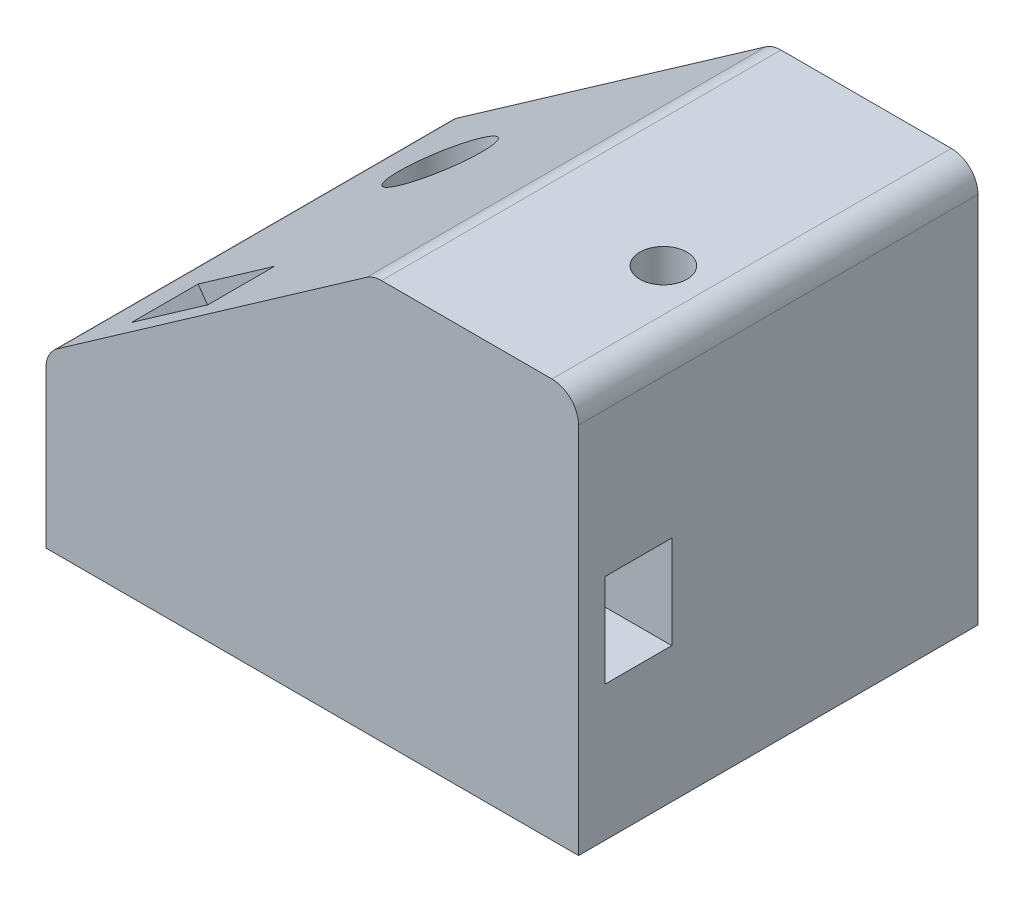
ISO-10303-21;
HEADER;
FILE_DESCRIPTION(('STEP AP214'),'2;1');
FILE_NAME('part.step','',(''),(''),'','','');
FILE_SCHEMA(('AUTOMOTIVE_DESIGN { 1 0 10303 214 1 1 1 1 }'));
ENDSEC;
DATA;
#1=APPLICATION_CONTEXT('core data for automotive mechanical design processes');
#2=APPLICATION_PROTOCOL_DEFINITION('international standard','automotive_design',2000,#1);
#3=PRODUCT_CONTEXT('',#1,'mechanical');
#4=PRODUCT('Part','Part','',(#3));
#5=PRODUCT_RELATED_PRODUCT_CATEGORY('part','',(#4));
#6=PRODUCT_DEFINITION_FORMATION('','',#4);
#7=PRODUCT_DEFINITION_CONTEXT('part definition',#1,'design');
#8=PRODUCT_DEFINITION('design','',#6,#7);
#9=PRODUCT_DEFINITION_SHAPE('','',#8);
#10=(LENGTH_UNIT() NAMED_UNIT(*) SI_UNIT(.MILLI.,.METRE.));
#11=(NAMED_UNIT(*) PLANE_ANGLE_UNIT() SI_UNIT($,.RADIAN.));
#12=(NAMED_UNIT(*) SI_UNIT($,.STERADIAN.) SOLID_ANGLE_UNIT());
#13=UNCERTAINTY_MEASURE_WITH_UNIT(LENGTH_MEASURE(1.E-05),#10,'distance_accuracy_value','');
#14=(GEOMETRIC_REPRESENTATION_CONTEXT(3) GLOBAL_UNCERTAINTY_ASSIGNED_CONTEXT((#13)) GLOBAL_UNIT_ASSIGNED_CONTEXT((#10,
#11,#12)) REPRESENTATION_CONTEXT('',''));
#15=CARTESIAN_POINT('',(0.,0.,0.));
#16=DIRECTION('',(0.,0.,1.));
#17=DIRECTION('',(1.,0.,0.));
#18=AXIS2_PLACEMENT_3D('',#15,#16,#17);
#19=CARTESIAN_POINT('',(10.414,74.93,10.922));
#20=DIRECTION('',(0.,-1.,0.));
#21=DIRECTION('',(0.,0.,-1.));
#22=AXIS2_PLACEMENT_3D('',#19,#20,#21);
#23=CYLINDRICAL_SURFACE('',#22,2.2479);
#24=CARTESIAN_POINT('',(10.414,0.,10.922));
#25=DIRECTION('',(0.,-1.,0.));
#26=DIRECTION('',(0.,0.,-1.));
#27=AXIS2_PLACEMENT_3D('',#24,#25,#26);
#28=CIRCLE('',#27,2.2479);
#29=CARTESIAN_POINT('',(10.414,0.,8.6741));
#30=VERTEX_POINT('',#29);
#31=EDGE_CURVE('E274',#30,#30,#28,.T.);
#32=ORIENTED_EDGE('',*,*,#31,.T.);
#33=EDGE_LOOP('',(#32));
#34=FACE_BOUND('',#33,.T.);
#35=CARTESIAN_POINT('',(10.414,15.24,10.922));
#36=DIRECTION('',(0.,1.,0.));
#37=DIRECTION('',(-1.,0.,0.));
#38=AXIS2_PLACEMENT_3D('',#35,#36,#37);
#39=CIRCLE('',#38,2.2479);
#40=CARTESIAN_POINT('',(8.1661,15.24,10.922));
#41=VERTEX_POINT('',#40);
#42=EDGE_CURVE('E268',#41,#41,#39,.F.);
#43=ORIENTED_EDGE('',*,*,#42,.F.);
#44=EDGE_LOOP('',(#43));
#45=FACE_BOUND('',#44,.T.);
#46=ADVANCED_FACE('F39',(#34,#45),#23,.F.);
#47=CARTESIAN_POINT('',(10.7197833662883,12.9001248019861,35.56));
#48=DIRECTION('',(0.819152044288991,0.573576436351047,0.));
#49=DIRECTION('',(-0.573576436351047,0.819152044288991,0.));
#50=AXIS2_PLACEMENT_3D('',#47,#48,#49);
#51=PLANE('',#50);
#52=DIRECTION('',(-0.573576436351047,0.819152044288991,0.));
#53=VECTOR('',#52,1.);
#54=CARTESIAN_POINT('',(10.7197833662883,12.9001248019861,35.56));
#55=LINE('',#54,#53);
#56=CARTESIAN_POINT('',(10.668,12.9740791133331,35.56));
#57=VERTEX_POINT('',#56);
#58=CARTESIAN_POINT('',(5.6206888471275,20.1823864757152,35.56));
#59=VERTEX_POINT('',#58);
#60=EDGE_CURVE('E203',#57,#59,#55,.T.);
#61=ORIENTED_EDGE('',*,*,#60,.F.);
#62=DIRECTION('',(0.,0.,-1.));
#63=VECTOR('',#62,1.);
#64=CARTESIAN_POINT('',(10.668,12.9740791133331,35.56));
#65=LINE('',#64,#63);
#66=CARTESIAN_POINT('',(10.668,12.9740791133331,29.21));
#67=VERTEX_POINT('',#66);
#68=EDGE_CURVE('E11',#57,#67,#65,.T.);
#69=ORIENTED_EDGE('',*,*,#68,.T.);
#70=DIRECTION('',(-0.573576436351047,0.819152044288991,0.));
#71=VECTOR('',#70,1.);
#72=CARTESIAN_POINT('',(10.7197833662883,12.9001248019861,29.21));
#73=LINE('',#72,#71);
#74=CARTESIAN_POINT('',(5.6206888471275,20.1823864757152,29.21));
#75=VERTEX_POINT('',#74);
#76=EDGE_CURVE('E63',#67,#75,#73,.T.);
#77=ORIENTED_EDGE('',*,*,#76,.T.);
#78=DIRECTION('',(0.,0.,-1.));
#79=VECTOR('',#78,1.);
#80=CARTESIAN_POINT('',(5.6206888471275,20.1823864757152,35.56));
#81=LINE('',#80,#79);
#82=EDGE_CURVE('E199',#59,#75,#81,.T.);
#83=ORIENTED_EDGE('',*,*,#82,.F.);
#84=EDGE_LOOP('',(#61,#69,#77,#83));
#85=FACE_BOUND('',#84,.T.);
#86=ADVANCED_FACE('F342',(#85),#51,.T.);
#87=CARTESIAN_POINT('',(30.5536676628314,37.6406461924941,38.1));
#88=DIRECTION('',(0.573576436351047,-0.819152044288991,0.));
#89=DIRECTION('',(0.819152044288991,0.573576436351047,0.));
#90=AXIS2_PLACEMENT_3D('',#87,#88,#89);
#91=PLANE('',#90);
#92=CARTESIAN_POINT('',(10.414,23.5386990779412,10.922));
#93=DIRECTION('',(0.573576436351047,-0.819152044288991,0.));
#94=DIRECTION('',(0.819152044288991,0.573576436351047,0.));
#95=AXIS2_PLACEMENT_3D('',#92,#93,#94);
#96=ELLIPSE('',#95,4.80618955595386,3.937);
#97=CARTESIAN_POINT('',(14.351,26.2954161558728,10.922));
#98=VERTEX_POINT('',#97);
#99=EDGE_CURVE('E43',#98,#98,#96,.T.);
#100=ORIENTED_EDGE('',*,*,#99,.T.);
#101=EDGE_LOOP('',(#100));
#102=FACE_BOUND('',#101,.T.);
#103=DIRECTION('',(-0.819152044288991,-0.573576436351047,0.));
#104=VECTOR('',#103,1.);
#105=CARTESIAN_POINT('',(30.5536676628314,37.6406461924941,0.));
#106=LINE('',#105,#104);
#107=CARTESIAN_POINT('',(30.5536676628314,37.6406461924941,0.));
#108=VERTEX_POINT('',#107);
#109=CARTESIAN_POINT('',(1.08311585166891,17.0051436591183,0.));
#110=VERTEX_POINT('',#109);
#111=EDGE_CURVE('E241',#108,#110,#106,.T.);
#112=ORIENTED_EDGE('',*,*,#111,.T.);
#113=DIRECTION('',(0.,0.,-1.));
#114=VECTOR('',#113,1.);
#115=CARTESIAN_POINT('',(1.08311585166891,17.0051436591183,38.1));
#116=LINE('',#115,#114);
#117=CARTESIAN_POINT('',(1.08311585166891,17.0051436591183,38.1));
#118=VERTEX_POINT('',#117);
#119=EDGE_CURVE('E246',#118,#110,#116,.T.);
#120=ORIENTED_EDGE('',*,*,#119,.F.);
#121=DIRECTION('',(-0.819152044288991,-0.573576436351047,0.));
#122=VECTOR('',#121,1.);
#123=CARTESIAN_POINT('',(30.5536676628314,37.6406461924941,38.1));
#124=LINE('',#123,#122);
#125=CARTESIAN_POINT('',(30.5536676628314,37.6406461924941,38.1));
#126=VERTEX_POINT('',#125);
#127=EDGE_CURVE('E224',#126,#118,#124,.T.);
#128=ORIENTED_EDGE('',*,*,#127,.F.);
#129=DIRECTION('',(0.,0.,-1.));
#130=VECTOR('',#129,1.);
#131=CARTESIAN_POINT('',(30.5536676628314,37.6406461924941,38.1));
#132=LINE('',#131,#130);
#133=EDGE_CURVE('E249',#126,#108,#132,.T.);
#134=ORIENTED_EDGE('',*,*,#133,.T.);
#135=EDGE_LOOP('',(#112,#120,#128,#134));
#136=FACE_BOUND('',#135,.T.);
#137=DIRECTION('',(0.819152044288991,0.573576436351047,0.));
#138=VECTOR('',#137,1.);
#139=CARTESIAN_POINT('',(5.6206888471275,20.1823864757152,29.21));
#140=LINE('',#139,#138);
#141=CARTESIAN_POINT('',(12.9029505208566,25.281480994876,29.21));
#142=VERTEX_POINT('',#141);
#143=EDGE_CURVE('E190',#75,#142,#140,.T.);
#144=ORIENTED_EDGE('',*,*,#143,.T.);
#145=DIRECTION('',(0.,0.,1.));
#146=VECTOR('',#145,1.);
#147=CARTESIAN_POINT('',(12.9029505208566,25.281480994876,29.21));
#148=LINE('',#147,#146);
#149=CARTESIAN_POINT('',(12.9029505208566,25.281480994876,35.56));
#150=VERTEX_POINT('',#149);
#151=EDGE_CURVE('E193',#142,#150,#148,.T.);
#152=ORIENTED_EDGE('',*,*,#151,.T.);
#153=DIRECTION('',(-0.819152044288991,-0.573576436351047,0.));
#154=VECTOR('',#153,1.);
#155=CARTESIAN_POINT('',(12.9029505208566,25.281480994876,35.56));
#156=LINE('',#155,#154);
#157=EDGE_CURVE('E196',#150,#59,#156,.T.);
#158=ORIENTED_EDGE('',*,*,#157,.T.);
#159=ORIENTED_EDGE('',*,*,#82,.T.);
#160=EDGE_LOOP('',(#144,#152,#158,#159));
#161=FACE_BOUND('',#160,.T.);
#162=ADVANCED_FACE('F326',(#102,#136,#161),#91,.F.);
#163=CARTESIAN_POINT('',(6.33607749600529E-13,14.9244974666244,38.1));
#164=DIRECTION('',(1.,0.,0.));
#165=DIRECTION('',(0.,1.,0.));
#166=AXIS2_PLACEMENT_3D('',#163,#164,#165);
#167=PLANE('',#166);
#168=DIRECTION('',(0.,-1.,0.));
#169=VECTOR('',#168,1.);
#170=CARTESIAN_POINT('',(6.33607749600529E-13,14.9244974666244,0.));
#171=LINE('',#170,#169);
#172=CARTESIAN_POINT('',(5.2432017061399E-13,14.9244974666244,0.));
#173=VERTEX_POINT('',#172);
#174=CARTESIAN_POINT('',(0.,0.,0.));
#175=VERTEX_POINT('',#174);
#176=EDGE_CURVE('E209',#173,#175,#171,.T.);
#177=ORIENTED_EDGE('',*,*,#176,.T.);
#178=DIRECTION('',(0.,0.,-1.));
#179=VECTOR('',#178,1.);
#180=CARTESIAN_POINT('',(0.,0.,38.1));
#181=LINE('',#180,#179);
#182=CARTESIAN_POINT('',(0.,0.,38.1));
#183=VERTEX_POINT('',#182);
#184=EDGE_CURVE('E48',#183,#175,#181,.T.);
#185=ORIENTED_EDGE('',*,*,#184,.F.);
#186=DIRECTION('',(0.,-1.,0.));
#187=VECTOR('',#186,1.);
#188=CARTESIAN_POINT('',(6.33607749600529E-13,14.9244974666244,38.1));
#189=LINE('',#188,#187);
#190=CARTESIAN_POINT('',(5.2432017061399E-13,14.9244974666244,38.1));
#191=VERTEX_POINT('',#190);
#192=EDGE_CURVE('E210',#191,#183,#189,.T.);
#193=ORIENTED_EDGE('',*,*,#192,.F.);
#194=DIRECTION('',(0.,0.,-1.));
#195=VECTOR('',#194,1.);
#196=CARTESIAN_POINT('',(5.2432017061399E-13,14.9244974666244,38.1));
#197=LINE('',#196,#195);
#198=EDGE_CURVE('E228',#191,#173,#197,.T.);
#199=ORIENTED_EDGE('',*,*,#198,.T.);
#200=EDGE_LOOP('',(#177,#185,#193,#199));
#201=FACE_BOUND('',#200,.T.);
#202=ADVANCED_FACE('F41',(#201),#167,.F.);
#203=CARTESIAN_POINT('',(0.,0.,38.1));
#204=DIRECTION('',(0.,1.,0.));
#205=DIRECTION('',(0.,0.,1.));
#206=AXIS2_PLACEMENT_3D('',#203,#204,#205);
#207=PLANE('',#206);
#208=CARTESIAN_POINT('',(44.214054574,0.,23.424710834));
#209=DIRECTION('',(0.,-1.,0.));
#210=DIRECTION('',(0.,0.,-1.));
#211=AXIS2_PLACEMENT_3D('',#208,#209,#210);
#212=CIRCLE('',#211,2.2479);
#213=CARTESIAN_POINT('',(44.214054574,0.,21.176810834));
#214=VERTEX_POINT('',#213);
#215=EDGE_CURVE('E267',#214,#214,#212,.T.);
#216=ORIENTED_EDGE('',*,*,#215,.F.);
#217=EDGE_LOOP('',(#216));
#218=FACE_BOUND('',#217,.T.);
#219=ORIENTED_EDGE('',*,*,#31,.F.);
#220=EDGE_LOOP('',(#219));
#221=FACE_BOUND('',#220,.T.);
#222=DIRECTION('',(1.,0.,0.));
#223=VECTOR('',#222,1.);
#224=CARTESIAN_POINT('',(0.,0.,0.));
#225=LINE('',#224,#223);
#226=CARTESIAN_POINT('',(50.8,0.,0.));
#227=VERTEX_POINT('',#226);
#228=EDGE_CURVE('E231',#175,#227,#225,.T.);
#229=ORIENTED_EDGE('',*,*,#228,.T.);
#230=DIRECTION('',(0.,0.,-1.));
#231=VECTOR('',#230,1.);
#232=CARTESIAN_POINT('',(50.8,0.,38.1));
#233=LINE('',#232,#231);
#234=CARTESIAN_POINT('',(50.8,0.,38.1));
#235=VERTEX_POINT('',#234);
#236=EDGE_CURVE('E261',#235,#227,#233,.T.);
#237=ORIENTED_EDGE('',*,*,#236,.F.);
#238=DIRECTION('',(1.,0.,0.));
#239=VECTOR('',#238,1.);
#240=CARTESIAN_POINT('',(0.,0.,38.1));
#241=LINE('',#240,#239);
#242=EDGE_CURVE('E213',#183,#235,#241,.T.);
#243=ORIENTED_EDGE('',*,*,#242,.F.);
#244=ORIENTED_EDGE('',*,*,#184,.T.);
#245=EDGE_LOOP('',(#229,#237,#243,#244));
#246=FACE_BOUND('',#245,.T.);
#247=ADVANCED_FACE('F286',(#218,#221,#246),#207,.F.);
#248=CARTESIAN_POINT('',(50.8,0.,38.1));
#249=DIRECTION('',(-1.,0.,0.));
#250=DIRECTION('',(0.,0.,1.));
#251=AXIS2_PLACEMENT_3D('',#248,#249,#250);
#252=PLANE('',#251);
#253=DIRECTION('',(0.,-1.,0.));
#254=VECTOR('',#253,1.);
#255=CARTESIAN_POINT('',(50.8,21.7901248019861,35.56));
#256=LINE('',#255,#254);
#257=CARTESIAN_POINT('',(50.8,21.7901248019861,35.56));
#258=VERTEX_POINT('',#257);
#259=CARTESIAN_POINT('',(50.8,12.9001248019861,35.56));
#260=VERTEX_POINT('',#259);
#261=EDGE_CURVE('E156',#258,#260,#256,.T.);
#262=ORIENTED_EDGE('',*,*,#261,.F.);
#263=DIRECTION('',(0.,0.,1.));
#264=VECTOR('',#263,1.);
#265=CARTESIAN_POINT('',(50.8,21.7901248019861,29.21));
#266=LINE('',#265,#264);
#267=CARTESIAN_POINT('',(50.8,21.7901248019861,29.21));
#268=VERTEX_POINT('',#267);
#269=EDGE_CURVE('E56',#268,#258,#266,.T.);
#270=ORIENTED_EDGE('',*,*,#269,.F.);
#271=DIRECTION('',(0.,1.,0.));
#272=VECTOR('',#271,1.);
#273=CARTESIAN_POINT('',(50.8,12.9001248019861,29.21));
#274=LINE('',#273,#272);
#275=CARTESIAN_POINT('',(50.8,12.9001248019861,29.21));
#276=VERTEX_POINT('',#275);
#277=EDGE_CURVE('E169',#276,#268,#274,.T.);
#278=ORIENTED_EDGE('',*,*,#277,.F.);
#279=DIRECTION('',(0.,0.,-1.));
#280=VECTOR('',#279,1.);
#281=CARTESIAN_POINT('',(50.8,12.9001248019861,29.21));
#282=LINE('',#281,#280);
#283=EDGE_CURVE('E180',#260,#276,#282,.T.);
#284=ORIENTED_EDGE('',*,*,#283,.F.);
#285=EDGE_LOOP('',(#262,#270,#278,#284));
#286=FACE_BOUND('',#285,.T.);
#287=DIRECTION('',(0.,1.,0.));
#288=VECTOR('',#287,1.);
#289=CARTESIAN_POINT('',(50.8,0.,0.));
#290=LINE('',#289,#288);
#291=CARTESIAN_POINT('',(50.8,35.5600000000002,0.));
#292=VERTEX_POINT('',#291);
#293=EDGE_CURVE('E233',#227,#292,#290,.T.);
#294=ORIENTED_EDGE('',*,*,#293,.T.);
#295=DIRECTION('',(0.,0.,-1.));
#296=VECTOR('',#295,1.);
#297=CARTESIAN_POINT('',(50.8,35.5600000000002,38.1));
#298=LINE('',#297,#296);
#299=CARTESIAN_POINT('',(50.8,35.5600000000002,38.1));
#300=VERTEX_POINT('',#299);
#301=EDGE_CURVE('E258',#300,#292,#298,.T.);
#302=ORIENTED_EDGE('',*,*,#301,.F.);
#303=DIRECTION('',(0.,1.,0.));
#304=VECTOR('',#303,1.);
#305=CARTESIAN_POINT('',(50.8,0.,38.1));
#306=LINE('',#305,#304);
#307=EDGE_CURVE('E216',#235,#300,#306,.T.);
#308=ORIENTED_EDGE('',*,*,#307,.F.);
#309=ORIENTED_EDGE('',*,*,#236,.T.);
#310=EDGE_LOOP('',(#294,#302,#308,#309));
#311=FACE_BOUND('',#310,.T.);
#312=ADVANCED_FACE('F289',(#286,#311),#252,.F.);
#313=CARTESIAN_POINT('',(48.2600000000001,35.5600000000002,38.1));
#314=DIRECTION('',(0.,0.,-1.));
#315=DIRECTION('',(-1.,0.,0.));
#316=AXIS2_PLACEMENT_3D('',#313,#314,#315);
#317=CYLINDRICAL_SURFACE('',#316,2.53999999999985);
#318=CARTESIAN_POINT('',(48.2600000000001,35.5600000000002,0.));
#319=DIRECTION('',(0.,0.,1.));
#320=DIRECTION('',(-1.,0.,0.));
#321=AXIS2_PLACEMENT_3D('',#318,#319,#320);
#322=CIRCLE('',#321,2.53999999999985);
#323=CARTESIAN_POINT('',(48.2600000000001,38.1,0.));
#324=VERTEX_POINT('',#323);
#325=EDGE_CURVE('E235',#292,#324,#322,.T.);
#326=ORIENTED_EDGE('',*,*,#325,.T.);
#327=DIRECTION('',(0.,0.,-1.));
#328=VECTOR('',#327,1.);
#329=CARTESIAN_POINT('',(48.2600000000001,38.1,38.1));
#330=LINE('',#329,#328);
#331=CARTESIAN_POINT('',(48.2600000000001,38.1,38.1));
#332=VERTEX_POINT('',#331);
#333=EDGE_CURVE('E255',#332,#324,#330,.T.);
#334=ORIENTED_EDGE('',*,*,#333,.F.);
#335=CARTESIAN_POINT('',(48.2600000000001,35.5600000000002,38.1));
#336=DIRECTION('',(0.,0.,1.));
#337=DIRECTION('',(-1.,0.,0.));
#338=AXIS2_PLACEMENT_3D('',#335,#336,#337);
#339=CIRCLE('',#338,2.53999999999985);
#340=EDGE_CURVE('E218',#300,#332,#339,.T.);
#341=ORIENTED_EDGE('',*,*,#340,.F.);
#342=ORIENTED_EDGE('',*,*,#301,.T.);
#343=EDGE_LOOP('',(#326,#334,#341,#342));
#344=FACE_BOUND('',#343,.T.);
#345=ADVANCED_FACE('F305',(#344),#317,.T.);
#346=CARTESIAN_POINT('',(48.2600000000001,38.1,38.1));
#347=DIRECTION('',(0.,-1.,0.));
#348=DIRECTION('',(1.,0.,0.));
#349=AXIS2_PLACEMENT_3D('',#346,#347,#348);
#350=PLANE('',#349);
#351=CARTESIAN_POINT('',(44.214054574,38.1,23.424710834));
#352=DIRECTION('',(0.,-1.,0.));
#353=DIRECTION('',(1.,0.,0.));
#354=AXIS2_PLACEMENT_3D('',#351,#352,#353);
#355=CIRCLE('',#354,2.2479);
#356=CARTESIAN_POINT('',(46.461954574,38.1,23.424710834));
#357=VERTEX_POINT('',#356);
#358=EDGE_CURVE('E178',#357,#357,#355,.T.);
#359=ORIENTED_EDGE('',*,*,#358,.T.);
#360=EDGE_LOOP('',(#359));
#361=FACE_BOUND('',#360,.T.);
#362=DIRECTION('',(-1.,0.,0.));
#363=VECTOR('',#362,1.);
#364=CARTESIAN_POINT('',(48.2600000000001,38.1,0.));
#365=LINE('',#364,#363);
#366=CARTESIAN_POINT('',(32.0105518111629,38.1,0.));
#367=VERTEX_POINT('',#366);
#368=EDGE_CURVE('E237',#324,#367,#365,.T.);
#369=ORIENTED_EDGE('',*,*,#368,.T.);
#370=DIRECTION('',(0.,0.,-1.));
#371=VECTOR('',#370,1.);
#372=CARTESIAN_POINT('',(32.0105518111629,38.1,38.1));
#373=LINE('',#372,#371);
#374=CARTESIAN_POINT('',(32.0105518111629,38.1,38.1));
#375=VERTEX_POINT('',#374);
#376=EDGE_CURVE('E252',#375,#367,#373,.T.);
#377=ORIENTED_EDGE('',*,*,#376,.F.);
#378=DIRECTION('',(-1.,0.,0.));
#379=VECTOR('',#378,1.);
#380=CARTESIAN_POINT('',(48.2600000000001,38.1,38.1));
#381=LINE('',#380,#379);
#382=EDGE_CURVE('E220',#332,#375,#381,.T.);
#383=ORIENTED_EDGE('',*,*,#382,.F.);
#384=ORIENTED_EDGE('',*,*,#333,.T.);
#385=EDGE_LOOP('',(#369,#377,#383,#384));
#386=FACE_BOUND('',#385,.T.);
#387=ADVANCED_FACE('F309',(#361,#386),#350,.F.);
#388=CARTESIAN_POINT('',(32.0105518111629,35.5600000000002,38.1));
#389=DIRECTION('',(0.,0.,-1.));
#390=DIRECTION('',(-1.,0.,0.));
#391=AXIS2_PLACEMENT_3D('',#388,#389,#390);
#392=CYLINDRICAL_SURFACE('',#391,2.53999999999984);
#393=CARTESIAN_POINT('',(32.0105518111629,35.5600000000002,0.));
#394=DIRECTION('',(0.,0.,1.));
#395=DIRECTION('',(1.,0.,0.));
#396=AXIS2_PLACEMENT_3D('',#393,#394,#395);
#397=CIRCLE('',#396,2.53999999999984);
#398=EDGE_CURVE('E239',#367,#108,#397,.T.);
#399=ORIENTED_EDGE('',*,*,#398,.T.);
#400=ORIENTED_EDGE('',*,*,#133,.F.);
#401=CARTESIAN_POINT('',(32.0105518111629,35.5600000000002,38.1));
#402=DIRECTION('',(0.,0.,1.));
#403=DIRECTION('',(1.,0.,0.));
#404=AXIS2_PLACEMENT_3D('',#401,#402,#403);
#405=CIRCLE('',#404,2.53999999999984);
#406=EDGE_CURVE('E222',#375,#126,#405,.T.);
#407=ORIENTED_EDGE('',*,*,#406,.F.);
#408=ORIENTED_EDGE('',*,*,#376,.T.);
#409=EDGE_LOOP('',(#399,#400,#407,#408));
#410=FACE_BOUND('',#409,.T.);
#411=ADVANCED_FACE('F329',(#410),#392,.T.);
#412=CARTESIAN_POINT('',(2.54000000000047,14.9244974666241,38.1));
#413=DIRECTION('',(0.,0.,-1.));
#414=DIRECTION('',(-1.,0.,0.));
#415=AXIS2_PLACEMENT_3D('',#412,#413,#414);
#416=CYLINDRICAL_SURFACE('',#415,2.53999999999995);
#417=CARTESIAN_POINT('',(2.54000000000047,14.9244974666241,0.));
#418=DIRECTION('',(0.,0.,1.));
#419=DIRECTION('',(-1.,0.,0.));
#420=AXIS2_PLACEMENT_3D('',#417,#418,#419);
#421=CIRCLE('',#420,2.53999999999995);
#422=EDGE_CURVE('E214',#110,#173,#421,.T.);
#423=ORIENTED_EDGE('',*,*,#422,.T.);
#424=ORIENTED_EDGE('',*,*,#198,.F.);
#425=CARTESIAN_POINT('',(2.54000000000047,14.9244974666241,38.1));
#426=DIRECTION('',(0.,0.,1.));
#427=DIRECTION('',(-1.,0.,0.));
#428=AXIS2_PLACEMENT_3D('',#425,#426,#427);
#429=CIRCLE('',#428,2.53999999999995);
#430=EDGE_CURVE('E226',#118,#191,#429,.T.);
#431=ORIENTED_EDGE('',*,*,#430,.F.);
#432=ORIENTED_EDGE('',*,*,#119,.T.);
#433=EDGE_LOOP('',(#423,#424,#431,#432));
#434=FACE_BOUND('',#433,.T.);
#435=ADVANCED_FACE('F322',(#434),#416,.T.);
#436=CARTESIAN_POINT('',(48.2600000000001,35.5600000000002,38.1));
#437=DIRECTION('',(0.,0.,-1.));
#438=DIRECTION('',(-1.,0.,0.));
#439=AXIS2_PLACEMENT_3D('',#436,#437,#438);
#440=PLANE('',#439);
#441=ORIENTED_EDGE('',*,*,#192,.T.);
#442=ORIENTED_EDGE('',*,*,#242,.T.);
#443=ORIENTED_EDGE('',*,*,#307,.T.);
#444=ORIENTED_EDGE('',*,*,#340,.T.);
#445=ORIENTED_EDGE('',*,*,#382,.T.);
#446=ORIENTED_EDGE('',*,*,#406,.T.);
#447=ORIENTED_EDGE('',*,*,#127,.T.);
#448=ORIENTED_EDGE('',*,*,#430,.T.);
#449=EDGE_LOOP('',(#441,#442,#443,#444,#445,#446,#447,#448));
#450=FACE_BOUND('',#449,.T.);
#451=ADVANCED_FACE('F313',(#450),#440,.F.);
#452=CARTESIAN_POINT('',(48.2600000000001,35.5600000000002,0.));
#453=DIRECTION('',(0.,0.,-1.));
#454=DIRECTION('',(-1.,0.,0.));
#455=AXIS2_PLACEMENT_3D('',#452,#453,#454);
#456=PLANE('',#455);
#457=ORIENTED_EDGE('',*,*,#176,.F.);
#458=ORIENTED_EDGE('',*,*,#422,.F.);
#459=ORIENTED_EDGE('',*,*,#111,.F.);
#460=ORIENTED_EDGE('',*,*,#398,.F.);
#461=ORIENTED_EDGE('',*,*,#368,.F.);
#462=ORIENTED_EDGE('',*,*,#325,.F.);
#463=ORIENTED_EDGE('',*,*,#293,.F.);
#464=ORIENTED_EDGE('',*,*,#228,.F.);
#465=EDGE_LOOP('',(#457,#458,#459,#460,#461,#462,#463,#464));
#466=FACE_BOUND('',#465,.T.);
#467=ADVANCED_FACE('F300',(#466),#456,.T.);
#468=CARTESIAN_POINT('',(10.7197833662883,12.9001248019861,29.21));
#469=DIRECTION('',(0.,0.,1.));
#470=DIRECTION('',(1.,0.,0.));
#471=AXIS2_PLACEMENT_3D('',#468,#469,#470);
#472=PLANE('',#471);
#473=DIRECTION('',(1.,0.,0.));
#474=VECTOR('',#473,1.);
#475=CARTESIAN_POINT('',(10.668,21.7901248019861,29.21));
#476=LINE('',#475,#474);
#477=CARTESIAN_POINT('',(15.3476244456933,21.7901248019861,29.21));
#478=VERTEX_POINT('',#477);
#479=EDGE_CURVE('E184',#478,#268,#476,.T.);
#480=ORIENTED_EDGE('',*,*,#479,.F.);
#481=DIRECTION('',(-0.573576436351047,0.819152044288991,0.));
#482=VECTOR('',#481,1.);
#483=CARTESIAN_POINT('',(18.0020450400174,17.9992193211469,29.21));
#484=LINE('',#483,#482);
#485=EDGE_CURVE('E207',#478,#142,#484,.T.);
#486=ORIENTED_EDGE('',*,*,#485,.T.);
#487=ORIENTED_EDGE('',*,*,#143,.F.);
#488=ORIENTED_EDGE('',*,*,#76,.F.);
#489=DIRECTION('',(0.,1.,0.));
#490=VECTOR('',#489,1.);
#491=CARTESIAN_POINT('',(10.668,12.9001248019861,29.21));
#492=LINE('',#491,#490);
#493=CARTESIAN_POINT('',(10.668,12.9001248019861,29.21));
#494=VERTEX_POINT('',#493);
#495=EDGE_CURVE('E172',#494,#67,#492,.T.);
#496=ORIENTED_EDGE('',*,*,#495,.F.);
#497=DIRECTION('',(1.,0.,0.));
#498=VECTOR('',#497,1.);
#499=CARTESIAN_POINT('',(10.668,12.9001248019861,29.21));
#500=LINE('',#499,#498);
#501=EDGE_CURVE('E161',#494,#276,#500,.T.);
#502=ORIENTED_EDGE('',*,*,#501,.T.);
#503=ORIENTED_EDGE('',*,*,#277,.T.);
#504=EDGE_LOOP('',(#480,#486,#487,#488,#496,#502,#503));
#505=FACE_BOUND('',#504,.T.);
#506=ADVANCED_FACE('F366',(#505),#472,.T.);
#507=CARTESIAN_POINT('',(18.0020450400174,17.9992193211469,29.21));
#508=DIRECTION('',(-0.819152044288991,-0.573576436351047,0.));
#509=DIRECTION('',(0.573576436351047,-0.819152044288991,0.));
#510=AXIS2_PLACEMENT_3D('',#507,#508,#509);
#511=PLANE('',#510);
#512=DIRECTION('',(0.,0.,-1.));
#513=VECTOR('',#512,1.);
#514=CARTESIAN_POINT('',(15.3476244456933,21.7901248019861,29.21));
#515=LINE('',#514,#513);
#516=CARTESIAN_POINT('',(15.3476244456933,21.7901248019861,35.56));
#517=VERTEX_POINT('',#516);
#518=EDGE_CURVE('E186',#517,#478,#515,.T.);
#519=ORIENTED_EDGE('',*,*,#518,.F.);
#520=DIRECTION('',(-0.573576436351047,0.819152044288991,0.));
#521=VECTOR('',#520,1.);
#522=CARTESIAN_POINT('',(18.0020450400174,17.9992193211469,35.56));
#523=LINE('',#522,#521);
#524=EDGE_CURVE('E205',#517,#150,#523,.T.);
#525=ORIENTED_EDGE('',*,*,#524,.T.);
#526=ORIENTED_EDGE('',*,*,#151,.F.);
#527=ORIENTED_EDGE('',*,*,#485,.F.);
#528=EDGE_LOOP('',(#519,#525,#526,#527));
#529=FACE_BOUND('',#528,.T.);
#530=ADVANCED_FACE('F363',(#529),#511,.T.);
#531=CARTESIAN_POINT('',(18.0020450400174,17.9992193211469,35.56));
#532=DIRECTION('',(0.,0.,-1.));
#533=DIRECTION('',(-1.,0.,0.));
#534=AXIS2_PLACEMENT_3D('',#531,#532,#533);
#535=PLANE('',#534);
#536=ORIENTED_EDGE('',*,*,#524,.F.);
#537=DIRECTION('',(1.,0.,0.));
#538=VECTOR('',#537,1.);
#539=CARTESIAN_POINT('',(10.668,21.7901248019861,35.56));
#540=LINE('',#539,#538);
#541=EDGE_CURVE('E162',#517,#258,#540,.T.);
#542=ORIENTED_EDGE('',*,*,#541,.T.);
#543=ORIENTED_EDGE('',*,*,#261,.T.);
#544=DIRECTION('',(1.,0.,0.));
#545=VECTOR('',#544,1.);
#546=CARTESIAN_POINT('',(10.668,12.9001248019861,35.56));
#547=LINE('',#546,#545);
#548=CARTESIAN_POINT('',(10.668,12.9001248019861,35.56));
#549=VERTEX_POINT('',#548);
#550=EDGE_CURVE('E149',#549,#260,#547,.T.);
#551=ORIENTED_EDGE('',*,*,#550,.F.);
#552=DIRECTION('',(0.,-1.,0.));
#553=VECTOR('',#552,1.);
#554=CARTESIAN_POINT('',(10.668,21.7901248019861,35.56));
#555=LINE('',#554,#553);
#556=EDGE_CURVE('E153',#57,#549,#555,.T.);
#557=ORIENTED_EDGE('',*,*,#556,.F.);
#558=ORIENTED_EDGE('',*,*,#60,.T.);
#559=ORIENTED_EDGE('',*,*,#157,.F.);
#560=EDGE_LOOP('',(#536,#542,#543,#551,#557,#558,#559));
#561=FACE_BOUND('',#560,.T.);
#562=ADVANCED_FACE('F152',(#561),#535,.T.);
#563=CARTESIAN_POINT('',(10.668,12.9001248019861,29.21));
#564=DIRECTION('',(0.,-1.,0.));
#565=DIRECTION('',(0.,0.,-1.));
#566=AXIS2_PLACEMENT_3D('',#563,#564,#565);
#567=PLANE('',#566);
#568=ORIENTED_EDGE('',*,*,#550,.T.);
#569=ORIENTED_EDGE('',*,*,#283,.T.);
#570=ORIENTED_EDGE('',*,*,#501,.F.);
#571=DIRECTION('',(0.,0.,-1.));
#572=VECTOR('',#571,1.);
#573=CARTESIAN_POINT('',(10.668,12.9001248019861,29.21));
#574=LINE('',#573,#572);
#575=EDGE_CURVE('E167',#549,#494,#574,.T.);
#576=ORIENTED_EDGE('',*,*,#575,.F.);
#577=EDGE_LOOP('',(#568,#569,#570,#576));
#578=FACE_BOUND('',#577,.T.);
#579=ADVANCED_FACE('F171',(#578),#567,.F.);
#580=CARTESIAN_POINT('',(10.668,21.7901248019861,29.21));
#581=DIRECTION('',(0.,1.,0.));
#582=DIRECTION('',(0.,0.,1.));
#583=AXIS2_PLACEMENT_3D('',#580,#581,#582);
#584=PLANE('',#583);
#585=ORIENTED_EDGE('',*,*,#518,.T.);
#586=ORIENTED_EDGE('',*,*,#479,.T.);
#587=ORIENTED_EDGE('',*,*,#269,.T.);
#588=ORIENTED_EDGE('',*,*,#541,.F.);
#589=EDGE_LOOP('',(#585,#586,#587,#588));
#590=FACE_BOUND('',#589,.T.);
#591=ADVANCED_FACE('F356',(#590),#584,.F.);
#592=CARTESIAN_POINT('',(10.668,0.,0.));
#593=DIRECTION('',(1.,0.,0.));
#594=DIRECTION('',(0.,0.,-1.));
#595=AXIS2_PLACEMENT_3D('',#592,#593,#594);
#596=PLANE('',#595);
#597=ORIENTED_EDGE('',*,*,#556,.T.);
#598=ORIENTED_EDGE('',*,*,#575,.T.);
#599=ORIENTED_EDGE('',*,*,#495,.T.);
#600=ORIENTED_EDGE('',*,*,#68,.F.);
#601=EDGE_LOOP('',(#597,#598,#599,#600));
#602=FACE_BOUND('',#601,.T.);
#603=ADVANCED_FACE('F166',(#602),#596,.T.);
#604=CARTESIAN_POINT('',(44.214054574,74.93,23.424710834));
#605=DIRECTION('',(0.,-1.,0.));
#606=DIRECTION('',(0.,0.,-1.));
#607=AXIS2_PLACEMENT_3D('',#604,#605,#606);
#608=CYLINDRICAL_SURFACE('',#607,2.2479);
#609=ORIENTED_EDGE('',*,*,#215,.T.);
#610=EDGE_LOOP('',(#609));
#611=FACE_BOUND('',#610,.T.);
#612=ORIENTED_EDGE('',*,*,#358,.F.);
#613=EDGE_LOOP('',(#612));
#614=FACE_BOUND('',#613,.T.);
#615=ADVANCED_FACE('F352',(#611,#614),#608,.F.);
#616=CARTESIAN_POINT('',(10.414,15.24,10.922));
#617=DIRECTION('',(0.,1.,0.));
#618=DIRECTION('',(-1.,0.,0.));
#619=AXIS2_PLACEMENT_3D('',#616,#617,#618);
#620=CYLINDRICAL_SURFACE('',#619,3.937);
#621=CARTESIAN_POINT('',(10.414,15.24,10.922));
#622=DIRECTION('',(0.,1.,0.));
#623=DIRECTION('',(-1.,0.,0.));
#624=AXIS2_PLACEMENT_3D('',#621,#622,#623);
#625=CIRCLE('',#624,3.937);
#626=CARTESIAN_POINT('',(6.477,15.24,10.922));
#627=VERTEX_POINT('',#626);
#628=EDGE_CURVE('E270',#627,#627,#625,.T.);
#629=ORIENTED_EDGE('',*,*,#628,.F.);
#630=EDGE_LOOP('',(#629));
#631=FACE_BOUND('',#630,.T.);
#632=ORIENTED_EDGE('',*,*,#99,.F.);
#633=EDGE_LOOP('',(#632));
#634=FACE_BOUND('',#633,.T.);
#635=ADVANCED_FACE('F381',(#631,#634),#620,.F.);
#636=CARTESIAN_POINT('',(10.414,15.24,10.922));
#637=DIRECTION('',(0.,1.,0.));
#638=DIRECTION('',(-1.,0.,0.));
#639=AXIS2_PLACEMENT_3D('',#636,#637,#638);
#640=PLANE('',#639);
#641=ORIENTED_EDGE('',*,*,#628,.T.);
#642=EDGE_LOOP('',(#641));
#643=FACE_BOUND('',#642,.T.);
#644=ORIENTED_EDGE('',*,*,#42,.T.);
#645=EDGE_LOOP('',(#644));
#646=FACE_BOUND('',#645,.T.);
#647=ADVANCED_FACE('F382',(#643,#646),#640,.T.);
#648=CLOSED_SHELL('',(#46,#86,#162,#202,#247,#312,#345,#387,#411,#435,#451,#467,#506,#530,#562,
#579,#591,#603,#615,#635,#647));
#649=MANIFOLD_SOLID_BREP('B2',#648);
#650=ADVANCED_BREP_SHAPE_REPRESENTATION('',(#18,#649),#14);
#651=SHAPE_DEFINITION_REPRESENTATION(#9,#650);
ENDSEC;
END-ISO-10303-21;
